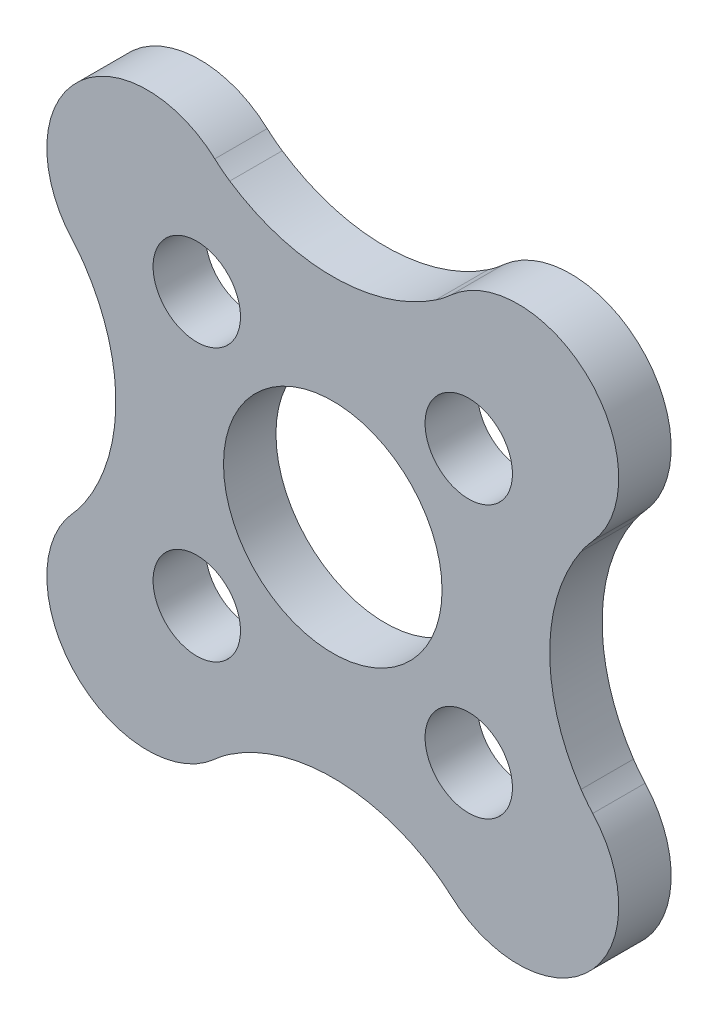
ISO-10303-21;
HEADER;
FILE_DESCRIPTION(('STEP AP214'),'2;1');
FILE_NAME('part.step','',(''),(''),'','','');
FILE_SCHEMA(('AUTOMOTIVE_DESIGN { 1 0 10303 214 1 1 1 1 }'));
ENDSEC;
DATA;
#1=APPLICATION_CONTEXT('core data for automotive mechanical design processes');
#2=APPLICATION_PROTOCOL_DEFINITION('international standard','automotive_design',2000,#1);
#3=PRODUCT_CONTEXT('',#1,'mechanical');
#4=PRODUCT('Part','Part','',(#3));
#5=PRODUCT_RELATED_PRODUCT_CATEGORY('part','',(#4));
#6=PRODUCT_DEFINITION_FORMATION('','',#4);
#7=PRODUCT_DEFINITION_CONTEXT('part definition',#1,'design');
#8=PRODUCT_DEFINITION('design','',#6,#7);
#9=PRODUCT_DEFINITION_SHAPE('','',#8);
#10=(LENGTH_UNIT() NAMED_UNIT(*) SI_UNIT(.MILLI.,.METRE.));
#11=(NAMED_UNIT(*) PLANE_ANGLE_UNIT() SI_UNIT($,.RADIAN.));
#12=(NAMED_UNIT(*) SI_UNIT($,.STERADIAN.) SOLID_ANGLE_UNIT());
#13=UNCERTAINTY_MEASURE_WITH_UNIT(LENGTH_MEASURE(1.E-05),#10,'distance_accuracy_value','');
#14=(GEOMETRIC_REPRESENTATION_CONTEXT(3) GLOBAL_UNCERTAINTY_ASSIGNED_CONTEXT((#13)) GLOBAL_UNIT_ASSIGNED_CONTEXT((#10,
#11,#12)) REPRESENTATION_CONTEXT('',''));
#15=CARTESIAN_POINT('',(0.,0.,0.));
#16=DIRECTION('',(0.,0.,1.));
#17=DIRECTION('',(1.,0.,0.));
#18=AXIS2_PLACEMENT_3D('',#15,#16,#17);
#19=CARTESIAN_POINT('',(8.97753154086215,16.3429104568438,1.2));
#20=DIRECTION('',(0.,0.,1.));
#21=DIRECTION('',(1.,0.,0.));
#22=AXIS2_PLACEMENT_3D('',#19,#20,#21);
#23=PLANE('',#22);
#24=CARTESIAN_POINT('',(12.0735176604385,16.989962178256,1.2));
#25=DIRECTION('',(0.,0.,1.));
#26=DIRECTION('',(1.,0.,0.));
#27=AXIS2_PLACEMENT_3D('',#24,#25,#26);
#28=CIRCLE('',#27,1.);
#29=CARTESIAN_POINT('',(13.0735176604385,16.989962178256,1.2));
#30=VERTEX_POINT('',#29);
#31=EDGE_CURVE('E866',#30,#30,#28,.T.);
#32=ORIENTED_EDGE('',*,*,#31,.F.);
#33=EDGE_LOOP('',(#32));
#34=FACE_BOUND('',#33,.T.);
#35=CARTESIAN_POINT('',(18.29605733488,10.7674225038145,1.2));
#36=DIRECTION('',(0.,0.,1.));
#37=DIRECTION('',(1.,0.,0.));
#38=AXIS2_PLACEMENT_3D('',#35,#36,#37);
#39=CIRCLE('',#38,1.);
#40=CARTESIAN_POINT('',(19.29605733488,10.7674225038145,1.2));
#41=VERTEX_POINT('',#40);
#42=EDGE_CURVE('E850',#41,#41,#39,.T.);
#43=ORIENTED_EDGE('',*,*,#42,.F.);
#44=EDGE_LOOP('',(#43));
#45=FACE_BOUND('',#44,.T.);
#46=CARTESIAN_POINT('',(10.94214681054,18.1213330281545,1.2));
#47=DIRECTION('',(0.,0.,1.));
#48=DIRECTION('',(1.,0.,0.));
#49=AXIS2_PLACEMENT_3D('',#46,#47,#48);
#50=CIRCLE('',#49,2.30000000000002);
#51=CARTESIAN_POINT('',(12.4856833818662,19.8264708093848,1.2));
#52=VERTEX_POINT('',#51);
#53=CARTESIAN_POINT('',(9.23700902930997,16.5777964568282,1.2));
#54=VERTEX_POINT('',#53);
#55=EDGE_CURVE('E397',#52,#54,#50,.T.);
#56=ORIENTED_EDGE('',*,*,#55,.T.);
#57=CARTESIAN_POINT('',(7.01291627118427,14.564487885533,1.2));
#58=DIRECTION('',(0.,0.,1.));
#59=DIRECTION('',(1.,0.,0.));
#60=AXIS2_PLACEMENT_3D('',#57,#58,#59);
#61=CIRCLE('',#60,2.99999999999961);
#62=CARTESIAN_POINT('',(9.50489487840609,16.2348299526398,1.2));
#63=VERTEX_POINT('',#62);
#64=EDGE_CURVE('E585',#63,#54,#61,.T.);
#65=ORIENTED_EDGE('',*,*,#64,.F.);
#66=CARTESIAN_POINT('',(5.98977983735266,13.8786923410353,1.2));
#67=DIRECTION('',(0.,0.,1.));
#68=DIRECTION('',(1.,0.,0.));
#69=AXIS2_PLACEMENT_3D('',#66,#67,#68);
#70=CIRCLE('',#69,4.23171575092862);
#71=CARTESIAN_POINT('',(9.50489487840625,11.5225547294311,1.2));
#72=VERTEX_POINT('',#71);
#73=EDGE_CURVE('E570',#72,#63,#70,.T.);
#74=ORIENTED_EDGE('',*,*,#73,.F.);
#75=CARTESIAN_POINT('',(7.01291627118376,13.192896796537,1.2));
#76=DIRECTION('',(0.,0.,1.));
#77=DIRECTION('',(1.,0.,0.));
#78=AXIS2_PLACEMENT_3D('',#75,#76,#77);
#79=CIRCLE('',#78,2.99999999999973);
#80=CARTESIAN_POINT('',(9.23700902930996,11.1795882252423,1.2));
#81=VERTEX_POINT('',#80);
#82=EDGE_CURVE('E584',#81,#72,#79,.T.);
#83=ORIENTED_EDGE('',*,*,#82,.F.);
#84=CARTESIAN_POINT('',(10.9421468105401,9.63605165391596,1.2));
#85=DIRECTION('',(0.,0.,1.));
#86=DIRECTION('',(1.,0.,0.));
#87=AXIS2_PLACEMENT_3D('',#84,#85,#86);
#88=CIRCLE('',#87,2.30000000000002);
#89=CARTESIAN_POINT('',(12.4856833818663,7.9309138726858,1.2));
#90=VERTEX_POINT('',#89);
#91=EDGE_CURVE('E590',#81,#90,#88,.T.);
#92=ORIENTED_EDGE('',*,*,#91,.T.);
#93=CARTESIAN_POINT('',(14.4989919531628,5.70682111455984,1.2));
#94=DIRECTION('',(0.,0.,1.));
#95=DIRECTION('',(1.,0.,0.));
#96=AXIS2_PLACEMENT_3D('',#93,#94,#95);
#97=CIRCLE('',#96,3.00000000000069);
#98=CARTESIAN_POINT('',(12.828649886055,8.19879972178226,1.2));
#99=VERTEX_POINT('',#98);
#100=EDGE_CURVE('E597',#99,#90,#97,.T.);
#101=ORIENTED_EDGE('',*,*,#100,.F.);
#102=CARTESIAN_POINT('',(15.1847874976592,4.68368468072872,1.2));
#103=DIRECTION('',(0.,0.,1.));
#104=DIRECTION('',(1.,0.,0.));
#105=AXIS2_PLACEMENT_3D('',#102,#103,#104);
#106=CIRCLE('',#105,4.23171575092856);
#107=CARTESIAN_POINT('',(17.5409251092637,8.19879972178209,1.2));
#108=VERTEX_POINT('',#107);
#109=EDGE_CURVE('E601',#108,#99,#106,.T.);
#110=ORIENTED_EDGE('',*,*,#109,.F.);
#111=CARTESIAN_POINT('',(15.8705830421569,5.70682111456031,1.2));
#112=DIRECTION('',(0.,0.,1.));
#113=DIRECTION('',(1.,0.,0.));
#114=AXIS2_PLACEMENT_3D('',#111,#112,#113);
#115=CIRCLE('',#114,2.9999999999996);
#116=CARTESIAN_POINT('',(17.8838916134524,7.9309138726857,1.2));
#117=VERTEX_POINT('',#116);
#118=EDGE_CURVE('E605',#117,#108,#115,.T.);
#119=ORIENTED_EDGE('',*,*,#118,.F.);
#120=CARTESIAN_POINT('',(19.4274281847784,9.63605165391604,1.2));
#121=DIRECTION('',(0.,0.,1.));
#122=DIRECTION('',(1.,0.,0.));
#123=AXIS2_PLACEMENT_3D('',#120,#121,#122);
#124=CIRCLE('',#123,2.30000000000002);
#125=CARTESIAN_POINT('',(21.1325659660086,11.1795882252423,1.2));
#126=VERTEX_POINT('',#125);
#127=EDGE_CURVE('E609',#117,#126,#124,.T.);
#128=ORIENTED_EDGE('',*,*,#127,.T.);
#129=CARTESIAN_POINT('',(23.3566587241348,13.192896796537,1.2));
#130=DIRECTION('',(0.,0.,1.));
#131=DIRECTION('',(1.,0.,0.));
#132=AXIS2_PLACEMENT_3D('',#129,#130,#131);
#133=CIRCLE('',#132,2.99999999999973);
#134=CARTESIAN_POINT('',(20.8646801169123,11.5225547294311,1.2));
#135=VERTEX_POINT('',#134);
#136=EDGE_CURVE('E612',#135,#126,#133,.T.);
#137=ORIENTED_EDGE('',*,*,#136,.F.);
#138=CARTESIAN_POINT('',(24.3797951579659,13.8786923410353,1.2));
#139=DIRECTION('',(0.,0.,1.));
#140=DIRECTION('',(1.,0.,0.));
#141=AXIS2_PLACEMENT_3D('',#138,#139,#140);
#142=CIRCLE('',#141,4.23171575092862);
#143=CARTESIAN_POINT('',(20.8646801169124,16.2348299526398,1.2));
#144=VERTEX_POINT('',#143);
#145=EDGE_CURVE('E616',#144,#135,#142,.T.);
#146=ORIENTED_EDGE('',*,*,#145,.F.);
#147=CARTESIAN_POINT('',(23.3566587241343,14.564487885533,1.2));
#148=DIRECTION('',(0.,0.,1.));
#149=DIRECTION('',(1.,0.,0.));
#150=AXIS2_PLACEMENT_3D('',#147,#148,#149);
#151=CIRCLE('',#150,2.99999999999962);
#152=CARTESIAN_POINT('',(21.1325659660086,16.5777964568282,1.2));
#153=VERTEX_POINT('',#152);
#154=EDGE_CURVE('E620',#153,#144,#151,.T.);
#155=ORIENTED_EDGE('',*,*,#154,.F.);
#156=CARTESIAN_POINT('',(19.4274281847785,18.1213330281545,1.2));
#157=DIRECTION('',(0.,0.,1.));
#158=DIRECTION('',(1.,0.,0.));
#159=AXIS2_PLACEMENT_3D('',#156,#157,#158);
#160=CIRCLE('',#159,2.30000000000003);
#161=CARTESIAN_POINT('',(17.8838916134523,19.8264708093848,1.2));
#162=VERTEX_POINT('',#161);
#163=EDGE_CURVE('E455',#153,#162,#160,.T.);
#164=ORIENTED_EDGE('',*,*,#163,.T.);
#165=CARTESIAN_POINT('',(15.870583042157,22.0505635675103,1.2));
#166=DIRECTION('',(0.,0.,1.));
#167=DIRECTION('',(1.,0.,0.));
#168=AXIS2_PLACEMENT_3D('',#165,#166,#167);
#169=CIRCLE('',#168,2.99999999999965);
#170=CARTESIAN_POINT('',(17.5409251092636,19.5585849602883,1.2));
#171=VERTEX_POINT('',#170);
#172=EDGE_CURVE('E441',#171,#162,#169,.T.);
#173=ORIENTED_EDGE('',*,*,#172,.F.);
#174=CARTESIAN_POINT('',(15.1847874976593,23.0737000013419,1.2));
#175=DIRECTION('',(0.,0.,1.));
#176=DIRECTION('',(1.,0.,0.));
#177=AXIS2_PLACEMENT_3D('',#174,#175,#176);
#178=CIRCLE('',#177,4.23171575092862);
#179=CARTESIAN_POINT('',(12.828649886055,19.5585849602884,1.2));
#180=VERTEX_POINT('',#179);
#181=EDGE_CURVE('E452',#180,#171,#178,.T.);
#182=ORIENTED_EDGE('',*,*,#181,.F.);
#183=CARTESIAN_POINT('',(14.4989919531611,22.0505635675107,1.2));
#184=DIRECTION('',(0.,0.,1.));
#185=DIRECTION('',(1.,0.,0.));
#186=AXIS2_PLACEMENT_3D('',#183,#184,#185);
#187=CIRCLE('',#186,2.99999999999961);
#188=EDGE_CURVE('E461',#52,#180,#187,.T.);
#189=ORIENTED_EDGE('',*,*,#188,.F.);
#190=EDGE_LOOP('',(#56,#65,#74,#83,#92,#101,#110,#119,#128,#137,#146,#155,#164,#173,#182,#189));
#191=FACE_BOUND('',#190,.T.);
#192=CARTESIAN_POINT('',(15.1847874976593,13.8786923410353,1.2));
#193=DIRECTION('',(0.,0.,1.));
#194=DIRECTION('',(1.,0.,0.));
#195=AXIS2_PLACEMENT_3D('',#192,#193,#194);
#196=CIRCLE('',#195,2.5);
#197=CARTESIAN_POINT('',(17.6847874976593,13.8786923410353,1.2));
#198=VERTEX_POINT('',#197);
#199=EDGE_CURVE('E471',#198,#198,#196,.T.);
#200=ORIENTED_EDGE('',*,*,#199,.F.);
#201=EDGE_LOOP('',(#200));
#202=FACE_BOUND('',#201,.T.);
#203=CARTESIAN_POINT('',(12.0735176604385,10.7674225038145,1.2));
#204=DIRECTION('',(0.,0.,1.));
#205=DIRECTION('',(1.,0.,0.));
#206=AXIS2_PLACEMENT_3D('',#203,#204,#205);
#207=CIRCLE('',#206,0.999999999999999);
#208=CARTESIAN_POINT('',(13.0735176604385,10.7674225038145,1.2));
#209=VERTEX_POINT('',#208);
#210=EDGE_CURVE('E858',#209,#209,#207,.T.);
#211=ORIENTED_EDGE('',*,*,#210,.F.);
#212=EDGE_LOOP('',(#211));
#213=FACE_BOUND('',#212,.T.);
#214=CARTESIAN_POINT('',(18.29605733488,16.989962178256,1.2));
#215=DIRECTION('',(0.,0.,1.));
#216=DIRECTION('',(1.,0.,0.));
#217=AXIS2_PLACEMENT_3D('',#214,#215,#216);
#218=CIRCLE('',#217,1.);
#219=CARTESIAN_POINT('',(19.29605733488,16.989962178256,1.2));
#220=VERTEX_POINT('',#219);
#221=EDGE_CURVE('E874',#220,#220,#218,.T.);
#222=ORIENTED_EDGE('',*,*,#221,.F.);
#223=EDGE_LOOP('',(#222));
#224=FACE_BOUND('',#223,.T.);
#225=ADVANCED_FACE('F318',(#34,#45,#191,#202,#213,#224),#23,.T.);
#226=CARTESIAN_POINT('',(8.97753154086215,16.3429104568438,0.));
#227=DIRECTION('',(0.,0.,1.));
#228=DIRECTION('',(1.,0.,0.));
#229=AXIS2_PLACEMENT_3D('',#226,#227,#228);
#230=PLANE('',#229);
#231=CARTESIAN_POINT('',(10.94214681054,18.1213330281545,0.));
#232=DIRECTION('',(0.,0.,1.));
#233=DIRECTION('',(1.,0.,0.));
#234=AXIS2_PLACEMENT_3D('',#231,#232,#233);
#235=CIRCLE('',#234,2.30000000000002);
#236=CARTESIAN_POINT('',(12.4856833818662,19.8264708093848,0.));
#237=VERTEX_POINT('',#236);
#238=CARTESIAN_POINT('',(9.23700902930997,16.5777964568282,0.));
#239=VERTEX_POINT('',#238);
#240=EDGE_CURVE('E467',#237,#239,#235,.T.);
#241=ORIENTED_EDGE('',*,*,#240,.F.);
#242=CARTESIAN_POINT('',(14.4989919531611,22.0505635675107,0.));
#243=DIRECTION('',(0.,0.,1.));
#244=DIRECTION('',(1.,0.,0.));
#245=AXIS2_PLACEMENT_3D('',#242,#243,#244);
#246=CIRCLE('',#245,2.99999999999961);
#247=CARTESIAN_POINT('',(12.828649886055,19.5585849602884,0.));
#248=VERTEX_POINT('',#247);
#249=EDGE_CURVE('E524',#237,#248,#246,.T.);
#250=ORIENTED_EDGE('',*,*,#249,.T.);
#251=CARTESIAN_POINT('',(15.1847874976593,23.0737000013419,0.));
#252=DIRECTION('',(0.,0.,1.));
#253=DIRECTION('',(1.,0.,0.));
#254=AXIS2_PLACEMENT_3D('',#251,#252,#253);
#255=CIRCLE('',#254,4.23171575092862);
#256=CARTESIAN_POINT('',(17.5409251092636,19.5585849602883,0.));
#257=VERTEX_POINT('',#256);
#258=EDGE_CURVE('E521',#248,#257,#255,.T.);
#259=ORIENTED_EDGE('',*,*,#258,.T.);
#260=CARTESIAN_POINT('',(15.870583042157,22.0505635675103,0.));
#261=DIRECTION('',(0.,0.,1.));
#262=DIRECTION('',(1.,0.,0.));
#263=AXIS2_PLACEMENT_3D('',#260,#261,#262);
#264=CIRCLE('',#263,2.99999999999965);
#265=CARTESIAN_POINT('',(17.8838916134523,19.8264708093848,0.));
#266=VERTEX_POINT('',#265);
#267=EDGE_CURVE('E443',#257,#266,#264,.T.);
#268=ORIENTED_EDGE('',*,*,#267,.T.);
#269=CARTESIAN_POINT('',(19.4274281847785,18.1213330281545,0.));
#270=DIRECTION('',(0.,0.,1.));
#271=DIRECTION('',(1.,0.,0.));
#272=AXIS2_PLACEMENT_3D('',#269,#270,#271);
#273=CIRCLE('',#272,2.30000000000003);
#274=CARTESIAN_POINT('',(21.1325659660086,16.5777964568282,0.));
#275=VERTEX_POINT('',#274);
#276=EDGE_CURVE('E515',#275,#266,#273,.T.);
#277=ORIENTED_EDGE('',*,*,#276,.F.);
#278=CARTESIAN_POINT('',(23.3566587241343,14.564487885533,0.));
#279=DIRECTION('',(0.,0.,1.));
#280=DIRECTION('',(1.,0.,0.));
#281=AXIS2_PLACEMENT_3D('',#278,#279,#280);
#282=CIRCLE('',#281,2.99999999999962);
#283=CARTESIAN_POINT('',(20.8646801169124,16.2348299526398,0.));
#284=VERTEX_POINT('',#283);
#285=EDGE_CURVE('E511',#275,#284,#282,.T.);
#286=ORIENTED_EDGE('',*,*,#285,.T.);
#287=CARTESIAN_POINT('',(24.3797951579659,13.8786923410353,0.));
#288=DIRECTION('',(0.,0.,1.));
#289=DIRECTION('',(1.,0.,0.));
#290=AXIS2_PLACEMENT_3D('',#287,#288,#289);
#291=CIRCLE('',#290,4.23171575092862);
#292=CARTESIAN_POINT('',(20.8646801169123,11.5225547294311,0.));
#293=VERTEX_POINT('',#292);
#294=EDGE_CURVE('E507',#284,#293,#291,.T.);
#295=ORIENTED_EDGE('',*,*,#294,.T.);
#296=CARTESIAN_POINT('',(23.3566587241348,13.192896796537,0.));
#297=DIRECTION('',(0.,0.,1.));
#298=DIRECTION('',(1.,0.,0.));
#299=AXIS2_PLACEMENT_3D('',#296,#297,#298);
#300=CIRCLE('',#299,2.99999999999973);
#301=CARTESIAN_POINT('',(21.1325659660086,11.1795882252423,0.));
#302=VERTEX_POINT('',#301);
#303=EDGE_CURVE('E503',#293,#302,#300,.T.);
#304=ORIENTED_EDGE('',*,*,#303,.T.);
#305=CARTESIAN_POINT('',(19.4274281847784,9.63605165391604,0.));
#306=DIRECTION('',(0.,0.,1.));
#307=DIRECTION('',(1.,0.,0.));
#308=AXIS2_PLACEMENT_3D('',#305,#306,#307);
#309=CIRCLE('',#308,2.30000000000002);
#310=CARTESIAN_POINT('',(17.8838916134524,7.9309138726857,0.));
#311=VERTEX_POINT('',#310);
#312=EDGE_CURVE('E499',#311,#302,#309,.T.);
#313=ORIENTED_EDGE('',*,*,#312,.F.);
#314=CARTESIAN_POINT('',(15.8705830421569,5.70682111456031,0.));
#315=DIRECTION('',(0.,0.,1.));
#316=DIRECTION('',(1.,0.,0.));
#317=AXIS2_PLACEMENT_3D('',#314,#315,#316);
#318=CIRCLE('',#317,2.9999999999996);
#319=CARTESIAN_POINT('',(17.5409251092637,8.19879972178209,0.));
#320=VERTEX_POINT('',#319);
#321=EDGE_CURVE('E495',#311,#320,#318,.T.);
#322=ORIENTED_EDGE('',*,*,#321,.T.);
#323=CARTESIAN_POINT('',(15.1847874976592,4.68368468072872,0.));
#324=DIRECTION('',(0.,0.,1.));
#325=DIRECTION('',(1.,0.,0.));
#326=AXIS2_PLACEMENT_3D('',#323,#324,#325);
#327=CIRCLE('',#326,4.23171575092856);
#328=CARTESIAN_POINT('',(12.828649886055,8.19879972178226,0.));
#329=VERTEX_POINT('',#328);
#330=EDGE_CURVE('E491',#320,#329,#327,.T.);
#331=ORIENTED_EDGE('',*,*,#330,.T.);
#332=CARTESIAN_POINT('',(14.4989919531628,5.70682111455984,0.));
#333=DIRECTION('',(0.,0.,1.));
#334=DIRECTION('',(1.,0.,0.));
#335=AXIS2_PLACEMENT_3D('',#332,#333,#334);
#336=CIRCLE('',#335,3.00000000000069);
#337=CARTESIAN_POINT('',(12.4856833818663,7.9309138726858,0.));
#338=VERTEX_POINT('',#337);
#339=EDGE_CURVE('E487',#329,#338,#336,.T.);
#340=ORIENTED_EDGE('',*,*,#339,.T.);
#341=CARTESIAN_POINT('',(10.9421468105401,9.63605165391596,0.));
#342=DIRECTION('',(0.,0.,1.));
#343=DIRECTION('',(1.,0.,0.));
#344=AXIS2_PLACEMENT_3D('',#341,#342,#343);
#345=CIRCLE('',#344,2.30000000000002);
#346=CARTESIAN_POINT('',(9.23700902930996,11.1795882252423,0.));
#347=VERTEX_POINT('',#346);
#348=EDGE_CURVE('E483',#347,#338,#345,.T.);
#349=ORIENTED_EDGE('',*,*,#348,.F.);
#350=CARTESIAN_POINT('',(7.01291627118376,13.192896796537,0.));
#351=DIRECTION('',(0.,0.,1.));
#352=DIRECTION('',(1.,0.,0.));
#353=AXIS2_PLACEMENT_3D('',#350,#351,#352);
#354=CIRCLE('',#353,2.99999999999973);
#355=CARTESIAN_POINT('',(9.50489487840625,11.5225547294311,0.));
#356=VERTEX_POINT('',#355);
#357=EDGE_CURVE('E479',#347,#356,#354,.T.);
#358=ORIENTED_EDGE('',*,*,#357,.T.);
#359=CARTESIAN_POINT('',(5.98977983735266,13.8786923410353,0.));
#360=DIRECTION('',(0.,0.,1.));
#361=DIRECTION('',(1.,0.,0.));
#362=AXIS2_PLACEMENT_3D('',#359,#360,#361);
#363=CIRCLE('',#362,4.23171575092862);
#364=CARTESIAN_POINT('',(9.50489487840609,16.2348299526398,0.));
#365=VERTEX_POINT('',#364);
#366=EDGE_CURVE('E475',#356,#365,#363,.T.);
#367=ORIENTED_EDGE('',*,*,#366,.T.);
#368=CARTESIAN_POINT('',(7.01291627118427,14.564487885533,0.));
#369=DIRECTION('',(0.,0.,1.));
#370=DIRECTION('',(1.,0.,0.));
#371=AXIS2_PLACEMENT_3D('',#368,#369,#370);
#372=CIRCLE('',#371,2.99999999999961);
#373=EDGE_CURVE('E470',#365,#239,#372,.T.);
#374=ORIENTED_EDGE('',*,*,#373,.T.);
#375=EDGE_LOOP('',(#241,#250,#259,#268,#277,#286,#295,#304,#313,#322,#331,#340,#349,#358,#367,#374));
#376=FACE_BOUND('',#375,.T.);
#377=CARTESIAN_POINT('',(15.1847874976593,13.8786923410353,0.));
#378=DIRECTION('',(0.,0.,1.));
#379=DIRECTION('',(1.,0.,0.));
#380=AXIS2_PLACEMENT_3D('',#377,#378,#379);
#381=CIRCLE('',#380,2.5);
#382=CARTESIAN_POINT('',(17.6847874976593,13.8786923410353,0.));
#383=VERTEX_POINT('',#382);
#384=EDGE_CURVE('E846',#383,#383,#381,.T.);
#385=ORIENTED_EDGE('',*,*,#384,.T.);
#386=EDGE_LOOP('',(#385));
#387=FACE_BOUND('',#386,.T.);
#388=CARTESIAN_POINT('',(18.29605733488,10.7674225038145,0.));
#389=DIRECTION('',(0.,0.,1.));
#390=DIRECTION('',(1.,0.,0.));
#391=AXIS2_PLACEMENT_3D('',#388,#389,#390);
#392=CIRCLE('',#391,1.);
#393=CARTESIAN_POINT('',(19.29605733488,10.7674225038145,0.));
#394=VERTEX_POINT('',#393);
#395=EDGE_CURVE('E854',#394,#394,#392,.T.);
#396=ORIENTED_EDGE('',*,*,#395,.T.);
#397=EDGE_LOOP('',(#396));
#398=FACE_BOUND('',#397,.T.);
#399=CARTESIAN_POINT('',(12.0735176604385,10.7674225038145,0.));
#400=DIRECTION('',(0.,0.,1.));
#401=DIRECTION('',(1.,0.,0.));
#402=AXIS2_PLACEMENT_3D('',#399,#400,#401);
#403=CIRCLE('',#402,0.999999999999999);
#404=CARTESIAN_POINT('',(13.0735176604385,10.7674225038145,0.));
#405=VERTEX_POINT('',#404);
#406=EDGE_CURVE('E862',#405,#405,#403,.T.);
#407=ORIENTED_EDGE('',*,*,#406,.T.);
#408=EDGE_LOOP('',(#407));
#409=FACE_BOUND('',#408,.T.);
#410=CARTESIAN_POINT('',(12.0735176604385,16.989962178256,0.));
#411=DIRECTION('',(0.,0.,1.));
#412=DIRECTION('',(1.,0.,0.));
#413=AXIS2_PLACEMENT_3D('',#410,#411,#412);
#414=CIRCLE('',#413,1.);
#415=CARTESIAN_POINT('',(13.0735176604385,16.989962178256,0.));
#416=VERTEX_POINT('',#415);
#417=EDGE_CURVE('E870',#416,#416,#414,.T.);
#418=ORIENTED_EDGE('',*,*,#417,.T.);
#419=EDGE_LOOP('',(#418));
#420=FACE_BOUND('',#419,.T.);
#421=CARTESIAN_POINT('',(18.29605733488,16.989962178256,0.));
#422=DIRECTION('',(0.,0.,1.));
#423=DIRECTION('',(1.,0.,0.));
#424=AXIS2_PLACEMENT_3D('',#421,#422,#423);
#425=CIRCLE('',#424,1.);
#426=CARTESIAN_POINT('',(19.29605733488,16.989962178256,0.));
#427=VERTEX_POINT('',#426);
#428=EDGE_CURVE('E878',#427,#427,#425,.T.);
#429=ORIENTED_EDGE('',*,*,#428,.T.);
#430=EDGE_LOOP('',(#429));
#431=FACE_BOUND('',#430,.T.);
#432=ADVANCED_FACE('F575',(#376,#387,#398,#409,#420,#431),#230,.F.);
#433=CARTESIAN_POINT('',(10.94214681054,18.1213330281545,1.2));
#434=DIRECTION('',(0.,0.,-1.));
#435=DIRECTION('',(-1.,0.,0.));
#436=AXIS2_PLACEMENT_3D('',#433,#434,#435);
#437=CYLINDRICAL_SURFACE('',#436,2.30000000000002);
#438=ORIENTED_EDGE('',*,*,#240,.T.);
#439=DIRECTION('',(0.,0.,-1.));
#440=VECTOR('',#439,1.);
#441=CARTESIAN_POINT('',(9.23700902930997,16.5777964568282,1.2));
#442=LINE('',#441,#440);
#443=EDGE_CURVE('E12',#54,#239,#442,.T.);
#444=ORIENTED_EDGE('',*,*,#443,.F.);
#445=ORIENTED_EDGE('',*,*,#55,.F.);
#446=DIRECTION('',(0.,0.,-1.));
#447=VECTOR('',#446,1.);
#448=CARTESIAN_POINT('',(12.4856833818662,19.8264708093848,1.2));
#449=LINE('',#448,#447);
#450=EDGE_CURVE('E336',#52,#237,#449,.T.);
#451=ORIENTED_EDGE('',*,*,#450,.T.);
#452=EDGE_LOOP('',(#438,#444,#445,#451));
#453=FACE_BOUND('',#452,.T.);
#454=ADVANCED_FACE('F320',(#453),#437,.T.);
#455=CARTESIAN_POINT('',(7.01291627118427,14.564487885533,1.2));
#456=DIRECTION('',(0.,0.,-1.));
#457=DIRECTION('',(-1.,0.,0.));
#458=AXIS2_PLACEMENT_3D('',#455,#456,#457);
#459=CYLINDRICAL_SURFACE('',#458,2.99999999999961);
#460=ORIENTED_EDGE('',*,*,#373,.F.);
#461=DIRECTION('',(0.,0.,-1.));
#462=VECTOR('',#461,1.);
#463=CARTESIAN_POINT('',(9.50489487840609,16.2348299526398,1.2));
#464=LINE('',#463,#462);
#465=EDGE_CURVE('E328',#63,#365,#464,.T.);
#466=ORIENTED_EDGE('',*,*,#465,.F.);
#467=ORIENTED_EDGE('',*,*,#64,.T.);
#468=ORIENTED_EDGE('',*,*,#443,.T.);
#469=EDGE_LOOP('',(#460,#466,#467,#468));
#470=FACE_BOUND('',#469,.T.);
#471=ADVANCED_FACE('F573',(#470),#459,.F.);
#472=CARTESIAN_POINT('',(5.98977983735266,13.8786923410353,1.2));
#473=DIRECTION('',(0.,0.,-1.));
#474=DIRECTION('',(-1.,0.,0.));
#475=AXIS2_PLACEMENT_3D('',#472,#473,#474);
#476=CYLINDRICAL_SURFACE('',#475,4.23171575092862);
#477=ORIENTED_EDGE('',*,*,#366,.F.);
#478=DIRECTION('',(0.,0.,-1.));
#479=VECTOR('',#478,1.);
#480=CARTESIAN_POINT('',(9.50489487840625,11.5225547294311,1.2));
#481=LINE('',#480,#479);
#482=EDGE_CURVE('E561',#72,#356,#481,.T.);
#483=ORIENTED_EDGE('',*,*,#482,.F.);
#484=ORIENTED_EDGE('',*,*,#73,.T.);
#485=ORIENTED_EDGE('',*,*,#465,.T.);
#486=EDGE_LOOP('',(#477,#483,#484,#485));
#487=FACE_BOUND('',#486,.T.);
#488=ADVANCED_FACE('F568',(#487),#476,.F.);
#489=CARTESIAN_POINT('',(7.01291627118376,13.192896796537,1.2));
#490=DIRECTION('',(0.,0.,-1.));
#491=DIRECTION('',(-1.,0.,0.));
#492=AXIS2_PLACEMENT_3D('',#489,#490,#491);
#493=CYLINDRICAL_SURFACE('',#492,2.99999999999973);
#494=ORIENTED_EDGE('',*,*,#357,.F.);
#495=DIRECTION('',(0.,0.,-1.));
#496=VECTOR('',#495,1.);
#497=CARTESIAN_POINT('',(9.23700902930996,11.1795882252423,1.2));
#498=LINE('',#497,#496);
#499=EDGE_CURVE('E558',#81,#347,#498,.T.);
#500=ORIENTED_EDGE('',*,*,#499,.F.);
#501=ORIENTED_EDGE('',*,*,#82,.T.);
#502=ORIENTED_EDGE('',*,*,#482,.T.);
#503=EDGE_LOOP('',(#494,#500,#501,#502));
#504=FACE_BOUND('',#503,.T.);
#505=ADVANCED_FACE('F580',(#504),#493,.F.);
#506=CARTESIAN_POINT('',(10.9421468105401,9.63605165391596,1.2));
#507=DIRECTION('',(0.,0.,-1.));
#508=DIRECTION('',(-1.,0.,0.));
#509=AXIS2_PLACEMENT_3D('',#506,#507,#508);
#510=CYLINDRICAL_SURFACE('',#509,2.30000000000002);
#511=ORIENTED_EDGE('',*,*,#348,.T.);
#512=DIRECTION('',(0.,0.,-1.));
#513=VECTOR('',#512,1.);
#514=CARTESIAN_POINT('',(12.4856833818663,7.9309138726858,1.2));
#515=LINE('',#514,#513);
#516=EDGE_CURVE('E555',#90,#338,#515,.T.);
#517=ORIENTED_EDGE('',*,*,#516,.F.);
#518=ORIENTED_EDGE('',*,*,#91,.F.);
#519=ORIENTED_EDGE('',*,*,#499,.T.);
#520=EDGE_LOOP('',(#511,#517,#518,#519));
#521=FACE_BOUND('',#520,.T.);
#522=ADVANCED_FACE('F785',(#521),#510,.T.);
#523=CARTESIAN_POINT('',(14.4989919531628,5.70682111455984,1.2));
#524=DIRECTION('',(0.,0.,-1.));
#525=DIRECTION('',(-1.,0.,0.));
#526=AXIS2_PLACEMENT_3D('',#523,#524,#525);
#527=CYLINDRICAL_SURFACE('',#526,3.00000000000069);
#528=ORIENTED_EDGE('',*,*,#339,.F.);
#529=DIRECTION('',(0.,0.,-1.));
#530=VECTOR('',#529,1.);
#531=CARTESIAN_POINT('',(12.828649886055,8.19879972178226,1.2));
#532=LINE('',#531,#530);
#533=EDGE_CURVE('E552',#99,#329,#532,.T.);
#534=ORIENTED_EDGE('',*,*,#533,.F.);
#535=ORIENTED_EDGE('',*,*,#100,.T.);
#536=ORIENTED_EDGE('',*,*,#516,.T.);
#537=EDGE_LOOP('',(#528,#534,#535,#536));
#538=FACE_BOUND('',#537,.T.);
#539=ADVANCED_FACE('F776',(#538),#527,.F.);
#540=CARTESIAN_POINT('',(15.1847874976592,4.68368468072872,1.2));
#541=DIRECTION('',(0.,0.,-1.));
#542=DIRECTION('',(-1.,0.,0.));
#543=AXIS2_PLACEMENT_3D('',#540,#541,#542);
#544=CYLINDRICAL_SURFACE('',#543,4.23171575092856);
#545=ORIENTED_EDGE('',*,*,#330,.F.);
#546=DIRECTION('',(0.,0.,-1.));
#547=VECTOR('',#546,1.);
#548=CARTESIAN_POINT('',(17.5409251092637,8.19879972178209,1.2));
#549=LINE('',#548,#547);
#550=EDGE_CURVE('E549',#108,#320,#549,.T.);
#551=ORIENTED_EDGE('',*,*,#550,.F.);
#552=ORIENTED_EDGE('',*,*,#109,.T.);
#553=ORIENTED_EDGE('',*,*,#533,.T.);
#554=EDGE_LOOP('',(#545,#551,#552,#553));
#555=FACE_BOUND('',#554,.T.);
#556=ADVANCED_FACE('F767',(#555),#544,.F.);
#557=CARTESIAN_POINT('',(15.8705830421569,5.70682111456031,1.2));
#558=DIRECTION('',(0.,0.,-1.));
#559=DIRECTION('',(-1.,0.,0.));
#560=AXIS2_PLACEMENT_3D('',#557,#558,#559);
#561=CYLINDRICAL_SURFACE('',#560,2.9999999999996);
#562=ORIENTED_EDGE('',*,*,#321,.F.);
#563=DIRECTION('',(0.,0.,-1.));
#564=VECTOR('',#563,1.);
#565=CARTESIAN_POINT('',(17.8838916134524,7.9309138726857,1.2));
#566=LINE('',#565,#564);
#567=EDGE_CURVE('E546',#117,#311,#566,.T.);
#568=ORIENTED_EDGE('',*,*,#567,.F.);
#569=ORIENTED_EDGE('',*,*,#118,.T.);
#570=ORIENTED_EDGE('',*,*,#550,.T.);
#571=EDGE_LOOP('',(#562,#568,#569,#570));
#572=FACE_BOUND('',#571,.T.);
#573=ADVANCED_FACE('F758',(#572),#561,.F.);
#574=CARTESIAN_POINT('',(19.4274281847784,9.63605165391604,1.2));
#575=DIRECTION('',(0.,0.,-1.));
#576=DIRECTION('',(-1.,0.,0.));
#577=AXIS2_PLACEMENT_3D('',#574,#575,#576);
#578=CYLINDRICAL_SURFACE('',#577,2.30000000000002);
#579=ORIENTED_EDGE('',*,*,#312,.T.);
#580=DIRECTION('',(0.,0.,-1.));
#581=VECTOR('',#580,1.);
#582=CARTESIAN_POINT('',(21.1325659660086,11.1795882252423,1.2));
#583=LINE('',#582,#581);
#584=EDGE_CURVE('E543',#126,#302,#583,.T.);
#585=ORIENTED_EDGE('',*,*,#584,.F.);
#586=ORIENTED_EDGE('',*,*,#127,.F.);
#587=ORIENTED_EDGE('',*,*,#567,.T.);
#588=EDGE_LOOP('',(#579,#585,#586,#587));
#589=FACE_BOUND('',#588,.T.);
#590=ADVANCED_FACE('F749',(#589),#578,.T.);
#591=CARTESIAN_POINT('',(23.3566587241348,13.192896796537,1.2));
#592=DIRECTION('',(0.,0.,-1.));
#593=DIRECTION('',(-1.,0.,0.));
#594=AXIS2_PLACEMENT_3D('',#591,#592,#593);
#595=CYLINDRICAL_SURFACE('',#594,2.99999999999973);
#596=ORIENTED_EDGE('',*,*,#303,.F.);
#597=DIRECTION('',(0.,0.,-1.));
#598=VECTOR('',#597,1.);
#599=CARTESIAN_POINT('',(20.8646801169123,11.5225547294311,1.2));
#600=LINE('',#599,#598);
#601=EDGE_CURVE('E540',#135,#293,#600,.T.);
#602=ORIENTED_EDGE('',*,*,#601,.F.);
#603=ORIENTED_EDGE('',*,*,#136,.T.);
#604=ORIENTED_EDGE('',*,*,#584,.T.);
#605=EDGE_LOOP('',(#596,#602,#603,#604));
#606=FACE_BOUND('',#605,.T.);
#607=ADVANCED_FACE('F741',(#606),#595,.F.);
#608=CARTESIAN_POINT('',(24.3797951579659,13.8786923410353,1.2));
#609=DIRECTION('',(0.,0.,-1.));
#610=DIRECTION('',(-1.,0.,0.));
#611=AXIS2_PLACEMENT_3D('',#608,#609,#610);
#612=CYLINDRICAL_SURFACE('',#611,4.23171575092862);
#613=ORIENTED_EDGE('',*,*,#294,.F.);
#614=DIRECTION('',(0.,0.,-1.));
#615=VECTOR('',#614,1.);
#616=CARTESIAN_POINT('',(20.8646801169124,16.2348299526398,1.2));
#617=LINE('',#616,#615);
#618=EDGE_CURVE('E537',#144,#284,#617,.T.);
#619=ORIENTED_EDGE('',*,*,#618,.F.);
#620=ORIENTED_EDGE('',*,*,#145,.T.);
#621=ORIENTED_EDGE('',*,*,#601,.T.);
#622=EDGE_LOOP('',(#613,#619,#620,#621));
#623=FACE_BOUND('',#622,.T.);
#624=ADVANCED_FACE('F631',(#623),#612,.F.);
#625=CARTESIAN_POINT('',(23.3566587241343,14.564487885533,1.2));
#626=DIRECTION('',(0.,0.,-1.));
#627=DIRECTION('',(-1.,0.,0.));
#628=AXIS2_PLACEMENT_3D('',#625,#626,#627);
#629=CYLINDRICAL_SURFACE('',#628,2.99999999999962);
#630=ORIENTED_EDGE('',*,*,#285,.F.);
#631=DIRECTION('',(0.,0.,-1.));
#632=VECTOR('',#631,1.);
#633=CARTESIAN_POINT('',(21.1325659660086,16.5777964568282,1.2));
#634=LINE('',#633,#632);
#635=EDGE_CURVE('E534',#153,#275,#634,.T.);
#636=ORIENTED_EDGE('',*,*,#635,.F.);
#637=ORIENTED_EDGE('',*,*,#154,.T.);
#638=ORIENTED_EDGE('',*,*,#618,.T.);
#639=EDGE_LOOP('',(#630,#636,#637,#638));
#640=FACE_BOUND('',#639,.T.);
#641=ADVANCED_FACE('F626',(#640),#629,.F.);
#642=CARTESIAN_POINT('',(19.4274281847785,18.1213330281545,1.2));
#643=DIRECTION('',(0.,0.,-1.));
#644=DIRECTION('',(-1.,0.,0.));
#645=AXIS2_PLACEMENT_3D('',#642,#643,#644);
#646=CYLINDRICAL_SURFACE('',#645,2.30000000000003);
#647=ORIENTED_EDGE('',*,*,#276,.T.);
#648=DIRECTION('',(0.,0.,-1.));
#649=VECTOR('',#648,1.);
#650=CARTESIAN_POINT('',(17.8838916134523,19.8264708093848,1.2));
#651=LINE('',#650,#649);
#652=EDGE_CURVE('E448',#162,#266,#651,.T.);
#653=ORIENTED_EDGE('',*,*,#652,.F.);
#654=ORIENTED_EDGE('',*,*,#163,.F.);
#655=ORIENTED_EDGE('',*,*,#635,.T.);
#656=EDGE_LOOP('',(#647,#653,#654,#655));
#657=FACE_BOUND('',#656,.T.);
#658=ADVANCED_FACE('F635',(#657),#646,.T.);
#659=CARTESIAN_POINT('',(15.870583042157,22.0505635675103,1.2));
#660=DIRECTION('',(0.,0.,-1.));
#661=DIRECTION('',(-1.,0.,0.));
#662=AXIS2_PLACEMENT_3D('',#659,#660,#661);
#663=CYLINDRICAL_SURFACE('',#662,2.99999999999965);
#664=ORIENTED_EDGE('',*,*,#267,.F.);
#665=DIRECTION('',(0.,0.,-1.));
#666=VECTOR('',#665,1.);
#667=CARTESIAN_POINT('',(17.5409251092636,19.5585849602883,1.2));
#668=LINE('',#667,#666);
#669=EDGE_CURVE('E438',#171,#257,#668,.T.);
#670=ORIENTED_EDGE('',*,*,#669,.F.);
#671=ORIENTED_EDGE('',*,*,#172,.T.);
#672=ORIENTED_EDGE('',*,*,#652,.T.);
#673=EDGE_LOOP('',(#664,#670,#671,#672));
#674=FACE_BOUND('',#673,.T.);
#675=ADVANCED_FACE('F440',(#674),#663,.F.);
#676=CARTESIAN_POINT('',(15.1847874976593,23.0737000013419,1.2));
#677=DIRECTION('',(0.,0.,-1.));
#678=DIRECTION('',(-1.,0.,0.));
#679=AXIS2_PLACEMENT_3D('',#676,#677,#678);
#680=CYLINDRICAL_SURFACE('',#679,4.23171575092862);
#681=ORIENTED_EDGE('',*,*,#258,.F.);
#682=DIRECTION('',(0.,0.,-1.));
#683=VECTOR('',#682,1.);
#684=CARTESIAN_POINT('',(12.828649886055,19.5585849602884,1.2));
#685=LINE('',#684,#683);
#686=EDGE_CURVE('E385',#180,#248,#685,.T.);
#687=ORIENTED_EDGE('',*,*,#686,.F.);
#688=ORIENTED_EDGE('',*,*,#181,.T.);
#689=ORIENTED_EDGE('',*,*,#669,.T.);
#690=EDGE_LOOP('',(#681,#687,#688,#689));
#691=FACE_BOUND('',#690,.T.);
#692=ADVANCED_FACE('F459',(#691),#680,.F.);
#693=CARTESIAN_POINT('',(14.4989919531611,22.0505635675107,1.2));
#694=DIRECTION('',(0.,0.,-1.));
#695=DIRECTION('',(-1.,0.,0.));
#696=AXIS2_PLACEMENT_3D('',#693,#694,#695);
#697=CYLINDRICAL_SURFACE('',#696,2.99999999999961);
#698=ORIENTED_EDGE('',*,*,#249,.F.);
#699=ORIENTED_EDGE('',*,*,#450,.F.);
#700=ORIENTED_EDGE('',*,*,#188,.T.);
#701=ORIENTED_EDGE('',*,*,#686,.T.);
#702=EDGE_LOOP('',(#698,#699,#700,#701));
#703=FACE_BOUND('',#702,.T.);
#704=ADVANCED_FACE('F657',(#703),#697,.F.);
#705=CARTESIAN_POINT('',(15.1847874976593,13.8786923410353,1.2));
#706=DIRECTION('',(0.,0.,-1.));
#707=DIRECTION('',(-1.,0.,0.));
#708=AXIS2_PLACEMENT_3D('',#705,#706,#707);
#709=CYLINDRICAL_SURFACE('',#708,2.5);
#710=ORIENTED_EDGE('',*,*,#199,.T.);
#711=EDGE_LOOP('',(#710));
#712=FACE_BOUND('',#711,.T.);
#713=ORIENTED_EDGE('',*,*,#384,.F.);
#714=EDGE_LOOP('',(#713));
#715=FACE_BOUND('',#714,.T.);
#716=ADVANCED_FACE('F654',(#712,#715),#709,.F.);
#717=CARTESIAN_POINT('',(18.29605733488,10.7674225038145,1.2));
#718=DIRECTION('',(0.,0.,-1.));
#719=DIRECTION('',(-1.,0.,0.));
#720=AXIS2_PLACEMENT_3D('',#717,#718,#719);
#721=CYLINDRICAL_SURFACE('',#720,1.);
#722=ORIENTED_EDGE('',*,*,#42,.T.);
#723=EDGE_LOOP('',(#722));
#724=FACE_BOUND('',#723,.T.);
#725=ORIENTED_EDGE('',*,*,#395,.F.);
#726=EDGE_LOOP('',(#725));
#727=FACE_BOUND('',#726,.T.);
#728=ADVANCED_FACE('F675',(#724,#727),#721,.F.);
#729=CARTESIAN_POINT('',(12.0735176604385,10.7674225038145,1.2));
#730=DIRECTION('',(0.,0.,-1.));
#731=DIRECTION('',(-1.,0.,0.));
#732=AXIS2_PLACEMENT_3D('',#729,#730,#731);
#733=CYLINDRICAL_SURFACE('',#732,0.999999999999999);
#734=ORIENTED_EDGE('',*,*,#210,.T.);
#735=EDGE_LOOP('',(#734));
#736=FACE_BOUND('',#735,.T.);
#737=ORIENTED_EDGE('',*,*,#406,.F.);
#738=EDGE_LOOP('',(#737));
#739=FACE_BOUND('',#738,.T.);
#740=ADVANCED_FACE('F682',(#736,#739),#733,.F.);
#741=CARTESIAN_POINT('',(12.0735176604385,16.989962178256,1.2));
#742=DIRECTION('',(0.,0.,-1.));
#743=DIRECTION('',(-1.,0.,0.));
#744=AXIS2_PLACEMENT_3D('',#741,#742,#743);
#745=CYLINDRICAL_SURFACE('',#744,1.);
#746=ORIENTED_EDGE('',*,*,#31,.T.);
#747=EDGE_LOOP('',(#746));
#748=FACE_BOUND('',#747,.T.);
#749=ORIENTED_EDGE('',*,*,#417,.F.);
#750=EDGE_LOOP('',(#749));
#751=FACE_BOUND('',#750,.T.);
#752=ADVANCED_FACE('F689',(#748,#751),#745,.F.);
#753=CARTESIAN_POINT('',(18.29605733488,16.989962178256,1.2));
#754=DIRECTION('',(0.,0.,-1.));
#755=DIRECTION('',(-1.,0.,0.));
#756=AXIS2_PLACEMENT_3D('',#753,#754,#755);
#757=CYLINDRICAL_SURFACE('',#756,1.);
#758=ORIENTED_EDGE('',*,*,#221,.T.);
#759=EDGE_LOOP('',(#758));
#760=FACE_BOUND('',#759,.T.);
#761=ORIENTED_EDGE('',*,*,#428,.F.);
#762=EDGE_LOOP('',(#761));
#763=FACE_BOUND('',#762,.T.);
#764=ADVANCED_FACE('F697',(#760,#763),#757,.F.);
#765=CLOSED_SHELL('',(#225,#432,#454,#471,#488,#505,#522,#539,#556,#573,#590,#607,#624,#641,
#658,#675,#692,#704,#716,#728,#740,#752,#764));
#766=MANIFOLD_SOLID_BREP('B2',#765);
#767=ADVANCED_BREP_SHAPE_REPRESENTATION('',(#18,#766),#14);
#768=SHAPE_DEFINITION_REPRESENTATION(#9,#767);
ENDSEC;
END-ISO-10303-21;
